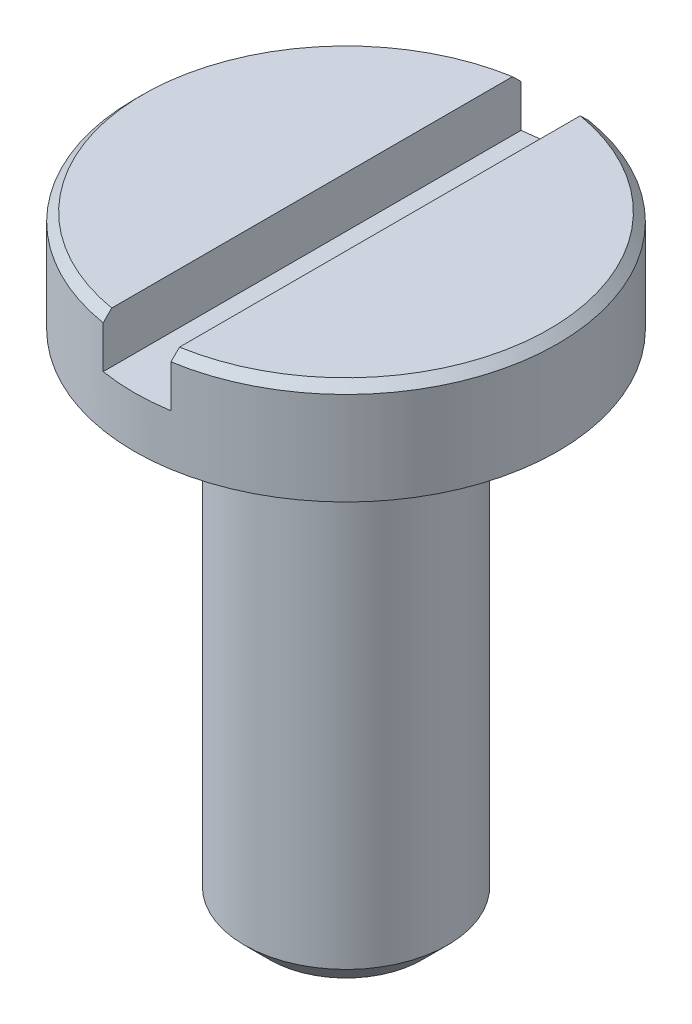
ISO-10303-21;
HEADER;
FILE_DESCRIPTION(('STEP AP214'),'2;1');
FILE_NAME('part.step','',(''),(''),'','','');
FILE_SCHEMA(('AUTOMOTIVE_DESIGN { 1 0 10303 214 1 1 1 1 }'));
ENDSEC;
DATA;
#1=APPLICATION_CONTEXT('core data for automotive mechanical design processes');
#2=APPLICATION_PROTOCOL_DEFINITION('international standard','automotive_design',2000,#1);
#3=PRODUCT_CONTEXT('',#1,'mechanical');
#4=PRODUCT('Part','Part','',(#3));
#5=PRODUCT_RELATED_PRODUCT_CATEGORY('part','',(#4));
#6=PRODUCT_DEFINITION_FORMATION('','',#4);
#7=PRODUCT_DEFINITION_CONTEXT('part definition',#1,'design');
#8=PRODUCT_DEFINITION('design','',#6,#7);
#9=PRODUCT_DEFINITION_SHAPE('','',#8);
#10=(LENGTH_UNIT() NAMED_UNIT(*) SI_UNIT(.MILLI.,.METRE.));
#11=(NAMED_UNIT(*) PLANE_ANGLE_UNIT() SI_UNIT($,.RADIAN.));
#12=(NAMED_UNIT(*) SI_UNIT($,.STERADIAN.) SOLID_ANGLE_UNIT());
#13=UNCERTAINTY_MEASURE_WITH_UNIT(LENGTH_MEASURE(1.E-05),#10,'distance_accuracy_value','');
#14=(GEOMETRIC_REPRESENTATION_CONTEXT(3) GLOBAL_UNCERTAINTY_ASSIGNED_CONTEXT((#13)) GLOBAL_UNIT_ASSIGNED_CONTEXT((#10,
#11,#12)) REPRESENTATION_CONTEXT('',''));
#15=CARTESIAN_POINT('',(0.,0.,0.));
#16=DIRECTION('',(0.,0.,1.));
#17=DIRECTION('',(1.,0.,0.));
#18=AXIS2_PLACEMENT_3D('',#15,#16,#17);
#19=CARTESIAN_POINT('',(0.,0.6,0.));
#20=DIRECTION('',(0.,1.,0.));
#21=DIRECTION('',(0.,0.,1.));
#22=AXIS2_PLACEMENT_3D('',#19,#20,#21);
#23=PLANE('',#22);
#24=DIRECTION('',(0.,0.,1.));
#25=VECTOR('',#24,1.);
#26=CARTESIAN_POINT('',(0.2,0.600000000000045,-1.25));
#27=LINE('',#26,#25);
#28=CARTESIAN_POINT('',(0.2,0.599999999999823,-1.18321595661988));
#29=VERTEX_POINT('',#28);
#30=CARTESIAN_POINT('',(0.2,0.599999999999823,1.18321595661988));
#31=VERTEX_POINT('',#30);
#32=EDGE_CURVE('E102',#29,#31,#27,.T.);
#33=ORIENTED_EDGE('',*,*,#32,.T.);
#34=CARTESIAN_POINT('',(0.,0.6,0.));
#35=DIRECTION('',(0.,1.,0.));
#36=DIRECTION('',(0.,0.,1.));
#37=AXIS2_PLACEMENT_3D('',#34,#35,#36);
#38=CIRCLE('',#37,1.2);
#39=EDGE_CURVE('E105',#31,#29,#38,.T.);
#40=ORIENTED_EDGE('',*,*,#39,.T.);
#41=EDGE_LOOP('',(#33,#40));
#42=FACE_BOUND('',#41,.T.);
#43=ADVANCED_FACE('F34',(#42),#23,.T.);
#44=CARTESIAN_POINT('',(0.,0.6,0.));
#45=DIRECTION('',(0.,-1.,0.));
#46=DIRECTION('',(0.,0.,-1.));
#47=AXIS2_PLACEMENT_3D('',#44,#45,#46);
#48=CONICAL_SURFACE('',#47,1.2,0.78539816339744);
#49=CARTESIAN_POINT('',(0.199999999999886,-0.950499970006001,2.74321892764739));
#50=CARTESIAN_POINT('',(0.199999999999893,-0.85521316276541,2.64767704238701));
#51=CARTESIAN_POINT('',(0.1999999999999,-0.759937513567608,2.55212401485427));
#52=CARTESIAN_POINT('',(0.199999999999914,-0.569420508066631,2.36097790814377));
#53=CARTESIAN_POINT('',(0.199999999999921,-0.474179152911256,2.26538482782206));
#54=CARTESIAN_POINT('',(0.199999999999935,-0.283680304847637,2.07407816347467));
#55=CARTESIAN_POINT('',(0.199999999999942,-0.188422849350493,1.97836454219386));
#56=CARTESIAN_POINT('',(0.199999999999956,0.00200973831289437,1.78686111472408));
#57=CARTESIAN_POINT('',(0.199999999999963,0.0971848728654708,1.69107131090932));
#58=CARTESIAN_POINT('',(0.199999999999977,0.286387712769196,1.50038687319419));
#59=CARTESIAN_POINT('',(0.199999999999984,0.38041680718345,1.40549361733739));
#60=CARTESIAN_POINT('',(0.199999999999998,0.568262322848238,1.2154799344842));
#61=CARTESIAN_POINT('',(0.200000000000005,0.662078724758933,1.12035948832674));
#62=CARTESIAN_POINT('',(0.200000000000015,0.802431191240111,0.977355461478562));
#63=CARTESIAN_POINT('',(0.200000000000018,0.849142887972829,0.929644297742755));
#64=CARTESIAN_POINT('',(0.200000000000025,0.942382748915012,0.834039211918449));
#65=CARTESIAN_POINT('',(0.200000000000029,0.988910906648579,0.786145283496622));
#66=CARTESIAN_POINT('',(0.200000000000035,1.08164699901678,0.690063753270319));
#67=CARTESIAN_POINT('',(0.200000000000039,1.12785498423148,0.641876200221872));
#68=CARTESIAN_POINT('',(0.200000000000046,1.21970773528638,0.544967994387595));
#69=CARTESIAN_POINT('',(0.200000000000049,1.26535254461765,0.496247383322212));
#70=CARTESIAN_POINT('',(0.200000000000053,1.32266782210179,0.433444864484505));
#71=CARTESIAN_POINT('',(0.200000000000054,1.33493377902086,0.41990768719576));
#72=CARTESIAN_POINT('',(0.200000000000056,1.35933321361233,0.392712938428519));
#73=CARTESIAN_POINT('',(0.200000000000057,1.37146668408859,0.37905536048243));
#74=CARTESIAN_POINT('',(0.200000000000059,1.40767513658386,0.337781215528018));
#75=CARTESIAN_POINT('',(0.200000000000061,1.43149053909029,0.309936528051617));
#76=CARTESIAN_POINT('',(0.200000000000064,1.47559765273767,0.255861694886954));
#77=CARTESIAN_POINT('',(0.200000000000066,1.49600843610721,0.229732167365978));
#78=CARTESIAN_POINT('',(0.200000000000068,1.52480518477775,0.18925858421655));
#79=CARTESIAN_POINT('',(0.200000000000069,1.53409437988248,0.175565259020838));
#80=CARTESIAN_POINT('',(0.20000000000007,1.55169168328672,0.147569344104482));
#81=CARTESIAN_POINT('',(0.200000000000071,1.56000099641343,0.133267532647374));
#82=CARTESIAN_POINT('',(0.200000000000072,1.57397551284466,0.105858050008022));
#83=CARTESIAN_POINT('',(0.200000000000072,1.57984745678161,0.0928587110503665));
#84=CARTESIAN_POINT('',(0.200000000000073,1.58969907939955,0.0661702015609263));
#85=CARTESIAN_POINT('',(0.200000000000073,1.5936851853496,0.0524835525617087));
#86=CARTESIAN_POINT('',(0.200000000000073,1.59850989657148,0.0269560064246883));
#87=CARTESIAN_POINT('',(0.200000000000073,1.59976945470394,0.0151985688248418));
#88=CARTESIAN_POINT('',(0.200000000000073,1.6001718043307,-0.00834316835147601));
#89=CARTESIAN_POINT('',(0.200000000000073,1.59931663499625,-0.0201274311120454));
#90=CARTESIAN_POINT('',(0.200000000000073,1.59516364543238,-0.046632359813152));
#91=CARTESIAN_POINT('',(0.200000000000073,1.5912493309678,-0.0612520830681338));
#92=CARTESIAN_POINT('',(0.200000000000072,1.58120047527907,-0.0897419347255407));
#93=CARTESIAN_POINT('',(0.200000000000072,1.57505325105002,-0.103607250128446));
#94=CARTESIAN_POINT('',(0.20000000000007,1.55683264697266,-0.139694012116542));
#95=CARTESIAN_POINT('',(0.200000000000069,1.54354967220904,-0.161283560008565));
#96=CARTESIAN_POINT('',(0.200000000000067,1.51522821534032,-0.203300232330449));
#97=CARTESIAN_POINT('',(0.200000000000066,1.50018421600613,-0.223723388178584));
#98=CARTESIAN_POINT('',(0.200000000000064,1.46906691381076,-0.263969274956352));
#99=CARTESIAN_POINT('',(0.200000000000063,1.45298784001529,-0.283787531009127));
#100=CARTESIAN_POINT('',(0.20000000000006,1.42030678861812,-0.322925503867143));
#101=CARTESIAN_POINT('',(0.200000000000059,1.40370572078283,-0.342245991712319));
#102=CARTESIAN_POINT('',(0.200000000000055,1.35391149998313,-0.399168778706729));
#103=CARTESIAN_POINT('',(0.200000000000053,1.32023024750236,-0.436342661674309));
#104=CARTESIAN_POINT('',(0.200000000000048,1.25224993849167,-0.510122852082956));
#105=CARTESIAN_POINT('',(0.200000000000045,1.2179507934654,-0.546729076802649));
#106=CARTESIAN_POINT('',(0.200000000000038,1.11448679964718,-0.656131274565132));
#107=CARTESIAN_POINT('',(0.200000000000033,1.04481402839601,-0.728446418955601));
#108=CARTESIAN_POINT('',(0.200000000000022,0.905416537934306,-0.872097092656359));
#109=CARTESIAN_POINT('',(0.200000000000017,0.835695199711297,-0.943435937459824));
#110=CARTESIAN_POINT('',(0.200000000000007,0.696002437153473,-1.08581877039426));
#111=CARTESIAN_POINT('',(0.200000000000002,0.626031111422726,-1.15686285505253));
#112=CARTESIAN_POINT('',(0.199999999999988,0.431455983866753,-1.35400414808119));
#113=CARTESIAN_POINT('',(0.199999999999979,0.306690384091999,-1.479941330513));
#114=CARTESIAN_POINT('',(0.19999999999996,0.0569299687690576,-1.73162420971081));
#115=CARTESIAN_POINT('',(0.199999999999951,-0.0680648773181554,-1.85736987615098));
#116=CARTESIAN_POINT('',(0.199999999999932,-0.319268602224971,-2.10984934365665));
#117=CARTESIAN_POINT('',(0.199999999999923,-0.445478504131675,-2.23658212643035));
#118=CARTESIAN_POINT('',(0.199999999999905,-0.697953823574084,-2.48995468743666));
#119=CARTESIAN_POINT('',(0.199999999999895,-0.824219230009358,-2.61659447672912));
#120=CARTESIAN_POINT('',(0.199999999999886,-0.950499970006002,-2.74321892764739));
#121=B_SPLINE_CURVE_WITH_KNOTS('',3,(#49,#50,#51,#52,#53,#54,#55,#56,#57,#58,#59,#60,#61,#62,
#63,#64,#65,#66,#67,#68,#69,#70,#71,#72,#73,#74,#75,#76,#77,#78,#79,#80,#81,#82,#83,#84,#85,#86,
#87,#88,#89,#90,#91,#92,#93,#94,#95,#96,#97,#98,#99,#100,#101,#102,#103,#104,#105,#106,#107,
#108,#109,#110,#111,#112,#113,#114,#115,#116,#117,#118,#119,#120),.UNSPECIFIED.,.F.,.F.,(4,2,2,
2,2,2,2,2,2,2,2,2,2,2,2,2,2,2,2,2,2,2,2,2,2,2,2,2,2,2,2,2,2,2,2,4),(0.,0.404809164288337,
0.809630808762067,1.21474277534173,1.61984257605578,2.02061153496668,2.42141558044582,
2.62172776074122,2.82204694664155,3.02233373006713,3.22260494836593,3.27740738256669,
3.33221277876293,3.44212264151892,3.5415107428698,3.59112809830151,3.64068379549018,
3.68338714841375,3.72594389320615,3.76124040239818,3.79650288944921,3.84163164166431,
3.88702084104461,3.96284904578586,4.03892151808884,4.11546271203283,4.19187718783774,
4.34234648879889,4.492837514494,4.79408069891004,5.0933346910438,5.39248141313244,
5.92430771282928,6.45621092333727,6.99278449758335,7.52927796906916),.UNSPECIFIED.);
#122=CARTESIAN_POINT('',(0.199999999999996,0.549999999999998,1.23389626792531));
#123=VERTEX_POINT('',#122);
#124=EDGE_CURVE('E172',#123,#31,#121,.T.);
#125=ORIENTED_EDGE('',*,*,#124,.F.);
#126=CARTESIAN_POINT('',(0.,0.549999999999998,0.));
#127=DIRECTION('',(0.,1.,0.));
#128=DIRECTION('',(0.,0.,1.));
#129=AXIS2_PLACEMENT_3D('',#126,#127,#128);
#130=CIRCLE('',#129,1.25);
#131=CARTESIAN_POINT('',(0.199999999999996,0.549999999999998,-1.23389626792531));
#132=VERTEX_POINT('',#131);
#133=EDGE_CURVE('E109',#132,#123,#130,.F.);
#134=ORIENTED_EDGE('',*,*,#133,.F.);
#135=EDGE_CURVE('E94',#29,#132,#121,.T.);
#136=ORIENTED_EDGE('',*,*,#135,.F.);
#137=ORIENTED_EDGE('',*,*,#39,.F.);
#138=EDGE_LOOP('',(#125,#134,#136,#137));
#139=FACE_BOUND('',#138,.T.);
#140=ADVANCED_FACE('F156',(#139),#48,.T.);
#141=CARTESIAN_POINT('',(0.,0.6,0.));
#142=DIRECTION('',(0.,-1.,0.));
#143=DIRECTION('',(0.,0.,-1.));
#144=AXIS2_PLACEMENT_3D('',#141,#142,#143);
#145=CYLINDRICAL_SURFACE('',#144,1.25);
#146=CARTESIAN_POINT('',(0.,0.299999999999877,0.));
#147=DIRECTION('',(0.,-1.,0.));
#148=DIRECTION('',(0.,0.,-1.));
#149=AXIS2_PLACEMENT_3D('',#146,#147,#148);
#150=CIRCLE('',#149,1.25);
#151=CARTESIAN_POINT('',(-0.199999999999978,0.299999999999877,-1.23389626792531));
#152=VERTEX_POINT('',#151);
#153=CARTESIAN_POINT('',(0.199999999999978,0.299999999999877,-1.23389626792531));
#154=VERTEX_POINT('',#153);
#155=EDGE_CURVE('E11',#152,#154,#150,.T.);
#156=ORIENTED_EDGE('',*,*,#155,.T.);
#157=DIRECTION('',(0.,-1.,0.));
#158=VECTOR('',#157,1.);
#159=CARTESIAN_POINT('',(0.2,0.599999999999985,-1.23389626792531));
#160=LINE('',#159,#158);
#161=EDGE_CURVE('E182',#154,#132,#160,.F.);
#162=ORIENTED_EDGE('',*,*,#161,.T.);
#163=ORIENTED_EDGE('',*,*,#133,.T.);
#164=DIRECTION('',(0.,-1.,0.));
#165=VECTOR('',#164,1.);
#166=CARTESIAN_POINT('',(0.2,0.599999999999985,1.23389626792531));
#167=LINE('',#166,#165);
#168=CARTESIAN_POINT('',(0.199999999999978,0.299999999999877,1.23389626792531));
#169=VERTEX_POINT('',#168);
#170=EDGE_CURVE('E57',#123,#169,#167,.T.);
#171=ORIENTED_EDGE('',*,*,#170,.T.);
#172=CARTESIAN_POINT('',(-0.199999999999978,0.299999999999877,1.23389626792531));
#173=VERTEX_POINT('',#172);
#174=EDGE_CURVE('E38',#169,#173,#150,.T.);
#175=ORIENTED_EDGE('',*,*,#174,.T.);
#176=DIRECTION('',(0.,-1.,0.));
#177=VECTOR('',#176,1.);
#178=CARTESIAN_POINT('',(-0.2,0.599999999999985,1.23389626792531));
#179=LINE('',#178,#177);
#180=CARTESIAN_POINT('',(-0.199999999999996,0.549999999999998,1.23389626792531));
#181=VERTEX_POINT('',#180);
#182=EDGE_CURVE('E177',#173,#181,#179,.F.);
#183=ORIENTED_EDGE('',*,*,#182,.T.);
#184=CARTESIAN_POINT('',(-0.199999999999996,0.549999999999998,-1.23389626792531));
#185=VERTEX_POINT('',#184);
#186=EDGE_CURVE('E117',#181,#185,#130,.F.);
#187=ORIENTED_EDGE('',*,*,#186,.T.);
#188=DIRECTION('',(0.,-1.,0.));
#189=VECTOR('',#188,1.);
#190=CARTESIAN_POINT('',(-0.2,0.599999999999985,-1.23389626792531));
#191=LINE('',#190,#189);
#192=EDGE_CURVE('E89',#185,#152,#191,.T.);
#193=ORIENTED_EDGE('',*,*,#192,.T.);
#194=EDGE_LOOP('',(#156,#162,#163,#171,#175,#183,#187,#193));
#195=FACE_BOUND('',#194,.T.);
#196=CARTESIAN_POINT('',(0.,0.,0.));
#197=DIRECTION('',(0.,1.,0.));
#198=DIRECTION('',(0.,0.,1.));
#199=AXIS2_PLACEMENT_3D('',#196,#197,#198);
#200=CIRCLE('',#199,1.25);
#201=CARTESIAN_POINT('',(0.,0.,1.25));
#202=VERTEX_POINT('',#201);
#203=EDGE_CURVE('E106',#202,#202,#200,.T.);
#204=ORIENTED_EDGE('',*,*,#203,.T.);
#205=EDGE_LOOP('',(#204));
#206=FACE_BOUND('',#205,.T.);
#207=ADVANCED_FACE('F152',(#195,#206),#145,.T.);
#208=DIRECTION('',(0.,0.,1.));
#209=VECTOR('',#208,1.);
#210=CARTESIAN_POINT('',(-0.2,0.600000000000045,-1.25));
#211=LINE('',#210,#209);
#212=CARTESIAN_POINT('',(-0.2,0.600000000000045,-1.1832159566201));
#213=VERTEX_POINT('',#212);
#214=CARTESIAN_POINT('',(-0.199999999999971,0.6,1.18321595661993));
#215=VERTEX_POINT('',#214);
#216=EDGE_CURVE('E49',#213,#215,#211,.T.);
#217=ORIENTED_EDGE('',*,*,#216,.F.);
#218=EDGE_CURVE('E100',#213,#215,#38,.T.);
#219=ORIENTED_EDGE('',*,*,#218,.T.);
#220=EDGE_LOOP('',(#217,#219));
#221=FACE_BOUND('',#220,.T.);
#222=ADVANCED_FACE('F99',(#221),#23,.T.);
#223=CARTESIAN_POINT('',(0.,0.,0.));
#224=DIRECTION('',(0.,1.,0.));
#225=DIRECTION('',(0.,0.,1.));
#226=AXIS2_PLACEMENT_3D('',#223,#224,#225);
#227=PLANE('',#226);
#228=CARTESIAN_POINT('',(0.,0.,0.));
#229=DIRECTION('',(0.,1.,0.));
#230=DIRECTION('',(0.,0.,1.));
#231=AXIS2_PLACEMENT_3D('',#228,#229,#230);
#232=CIRCLE('',#231,0.6);
#233=CARTESIAN_POINT('',(0.,0.,0.6));
#234=VERTEX_POINT('',#233);
#235=EDGE_CURVE('E111',#234,#234,#232,.T.);
#236=ORIENTED_EDGE('',*,*,#235,.T.);
#237=EDGE_LOOP('',(#236));
#238=FACE_BOUND('',#237,.T.);
#239=ORIENTED_EDGE('',*,*,#203,.F.);
#240=EDGE_LOOP('',(#239));
#241=FACE_BOUND('',#240,.T.);
#242=ADVANCED_FACE('F148',(#238,#241),#227,.F.);
#243=CARTESIAN_POINT('',(0.,-3.,0.));
#244=DIRECTION('',(0.,1.,0.));
#245=DIRECTION('',(0.,0.,1.));
#246=AXIS2_PLACEMENT_3D('',#243,#244,#245);
#247=CYLINDRICAL_SURFACE('',#246,0.6);
#248=CARTESIAN_POINT('',(0.,-2.85,0.));
#249=DIRECTION('',(0.,1.,0.));
#250=DIRECTION('',(0.,0.,1.));
#251=AXIS2_PLACEMENT_3D('',#248,#249,#250);
#252=CIRCLE('',#251,0.6);
#253=CARTESIAN_POINT('',(0.,-2.85,0.6));
#254=VERTEX_POINT('',#253);
#255=EDGE_CURVE('E118',#254,#254,#252,.T.);
#256=ORIENTED_EDGE('',*,*,#255,.T.);
#257=EDGE_LOOP('',(#256));
#258=FACE_BOUND('',#257,.T.);
#259=ORIENTED_EDGE('',*,*,#235,.F.);
#260=EDGE_LOOP('',(#259));
#261=FACE_BOUND('',#260,.T.);
#262=ADVANCED_FACE('F144',(#258,#261),#247,.T.);
#263=CARTESIAN_POINT('',(0.,-3.,0.));
#264=DIRECTION('',(0.,1.,0.));
#265=DIRECTION('',(0.,0.,1.));
#266=AXIS2_PLACEMENT_3D('',#263,#264,#265);
#267=PLANE('',#266);
#268=CARTESIAN_POINT('',(0.,-3.,0.));
#269=DIRECTION('',(0.,1.,0.));
#270=DIRECTION('',(0.,0.,1.));
#271=AXIS2_PLACEMENT_3D('',#268,#269,#270);
#272=CIRCLE('',#271,0.449999999999999);
#273=CARTESIAN_POINT('',(0.,-3.,0.449999999999999));
#274=VERTEX_POINT('',#273);
#275=EDGE_CURVE('E121',#274,#274,#272,.F.);
#276=ORIENTED_EDGE('',*,*,#275,.T.);
#277=EDGE_LOOP('',(#276));
#278=FACE_BOUND('',#277,.T.);
#279=ADVANCED_FACE('F141',(#278),#267,.F.);
#280=CARTESIAN_POINT('',(-0.199999999999886,-0.950499970006001,-2.74321892764739));
#281=CARTESIAN_POINT('',(-0.199999999999893,-0.85521316276541,-2.64767704238701));
#282=CARTESIAN_POINT('',(-0.1999999999999,-0.759937513567608,-2.55212401485427));
#283=CARTESIAN_POINT('',(-0.199999999999914,-0.569420508066631,-2.36097790814377));
#284=CARTESIAN_POINT('',(-0.199999999999921,-0.474179152911257,-2.26538482782206));
#285=CARTESIAN_POINT('',(-0.199999999999935,-0.283680304847639,-2.07407816347467));
#286=CARTESIAN_POINT('',(-0.199999999999942,-0.188422849350494,-1.97836454219386));
#287=CARTESIAN_POINT('',(-0.199999999999956,0.00200973831289268,-1.78686111472408));
#288=CARTESIAN_POINT('',(-0.199999999999963,0.097184872865469,-1.69107131090932));
#289=CARTESIAN_POINT('',(-0.199999999999977,0.286387712769194,-1.5003868731942));
#290=CARTESIAN_POINT('',(-0.199999999999984,0.380416807183448,-1.40549361733739));
#291=CARTESIAN_POINT('',(-0.199999999999998,0.568262322848236,-1.2154799344842));
#292=CARTESIAN_POINT('',(-0.200000000000005,0.662078724758932,-1.12035948832674));
#293=CARTESIAN_POINT('',(-0.200000000000015,0.80243119124011,-0.977355461478563));
#294=CARTESIAN_POINT('',(-0.200000000000018,0.849142887972828,-0.929644297742756));
#295=CARTESIAN_POINT('',(-0.200000000000025,0.942382748915011,-0.83403921191845));
#296=CARTESIAN_POINT('',(-0.200000000000029,0.988910906648578,-0.786145283496623));
#297=CARTESIAN_POINT('',(-0.200000000000035,1.08164699901678,-0.69006375327032));
#298=CARTESIAN_POINT('',(-0.200000000000039,1.12785498423148,-0.641876200221873));
#299=CARTESIAN_POINT('',(-0.200000000000046,1.21970773528638,-0.544967994387596));
#300=CARTESIAN_POINT('',(-0.200000000000049,1.26535254461765,-0.496247383322213));
#301=CARTESIAN_POINT('',(-0.200000000000053,1.32266782210179,-0.433444864484506));
#302=CARTESIAN_POINT('',(-0.200000000000054,1.33493377902085,-0.419907687195761));
#303=CARTESIAN_POINT('',(-0.200000000000056,1.35933321361233,-0.39271293842852));
#304=CARTESIAN_POINT('',(-0.200000000000057,1.37146668408859,-0.37905536048243));
#305=CARTESIAN_POINT('',(-0.200000000000059,1.40767513658386,-0.337781215528018));
#306=CARTESIAN_POINT('',(-0.200000000000061,1.43149053909029,-0.309936528051618));
#307=CARTESIAN_POINT('',(-0.200000000000064,1.47559765273767,-0.255861694886955));
#308=CARTESIAN_POINT('',(-0.200000000000066,1.49600843610721,-0.229732167365978));
#309=CARTESIAN_POINT('',(-0.200000000000068,1.52480518477775,-0.18925858421655));
#310=CARTESIAN_POINT('',(-0.200000000000069,1.53409437988248,-0.175565259020838));
#311=CARTESIAN_POINT('',(-0.20000000000007,1.55169168328672,-0.147569344104481));
#312=CARTESIAN_POINT('',(-0.200000000000071,1.56000099641343,-0.133267532647373));
#313=CARTESIAN_POINT('',(-0.200000000000072,1.57397551284466,-0.105858050008022));
#314=CARTESIAN_POINT('',(-0.200000000000072,1.57984745678161,-0.0928587110503661));
#315=CARTESIAN_POINT('',(-0.200000000000073,1.58969907939955,-0.0661702015609259));
#316=CARTESIAN_POINT('',(-0.200000000000073,1.5936851853496,-0.0524835525617083));
#317=CARTESIAN_POINT('',(-0.200000000000073,1.59850989657148,-0.0269560064246879));
#318=CARTESIAN_POINT('',(-0.200000000000073,1.59976945470394,-0.0151985688248413));
#319=CARTESIAN_POINT('',(-0.200000000000073,1.6001718043307,0.00834316835147648));
#320=CARTESIAN_POINT('',(-0.200000000000073,1.59931663499625,0.0201274311120459));
#321=CARTESIAN_POINT('',(-0.200000000000073,1.59516364543238,0.0466323598131525));
#322=CARTESIAN_POINT('',(-0.200000000000073,1.5912493309678,0.0612520830681344));
#323=CARTESIAN_POINT('',(-0.200000000000072,1.58120047527907,0.0897419347255414));
#324=CARTESIAN_POINT('',(-0.200000000000072,1.57505325105002,0.103607250128447));
#325=CARTESIAN_POINT('',(-0.20000000000007,1.55683264697266,0.139694012116543));
#326=CARTESIAN_POINT('',(-0.200000000000069,1.54354967220904,0.161283560008567));
#327=CARTESIAN_POINT('',(-0.200000000000067,1.51522821534031,0.203300232330451));
#328=CARTESIAN_POINT('',(-0.200000000000066,1.50018421600613,0.223723388178586));
#329=CARTESIAN_POINT('',(-0.200000000000064,1.46906691381076,0.263969274956354));
#330=CARTESIAN_POINT('',(-0.200000000000063,1.45298784001529,0.28378753100913));
#331=CARTESIAN_POINT('',(-0.20000000000006,1.42030678861812,0.322925503867146));
#332=CARTESIAN_POINT('',(-0.200000000000059,1.40370572078283,0.342245991712322));
#333=CARTESIAN_POINT('',(-0.200000000000055,1.35391149998313,0.399168778706733));
#334=CARTESIAN_POINT('',(-0.200000000000053,1.32023024750236,0.436342661674313));
#335=CARTESIAN_POINT('',(-0.200000000000048,1.25224993849166,0.510122852082961));
#336=CARTESIAN_POINT('',(-0.200000000000045,1.21795079346539,0.546729076802654));
#337=CARTESIAN_POINT('',(-0.200000000000038,1.11448679964718,0.656131274565139));
#338=CARTESIAN_POINT('',(-0.200000000000033,1.044814028396,0.728446418955608));
#339=CARTESIAN_POINT('',(-0.200000000000022,0.905416537934298,0.872097092656367));
#340=CARTESIAN_POINT('',(-0.200000000000017,0.835695199711288,0.943435937459833));
#341=CARTESIAN_POINT('',(-0.200000000000007,0.696002437153462,1.08581877039427));
#342=CARTESIAN_POINT('',(-0.200000000000002,0.626031111422714,1.15686285505254));
#343=CARTESIAN_POINT('',(-0.199999999999988,0.431455983866742,1.3540041480812));
#344=CARTESIAN_POINT('',(-0.199999999999979,0.306690384091988,1.47994133051302));
#345=CARTESIAN_POINT('',(-0.19999999999996,0.0569299687690492,1.73162420971082));
#346=CARTESIAN_POINT('',(-0.199999999999951,-0.0680648773181626,1.85736987615099));
#347=CARTESIAN_POINT('',(-0.199999999999932,-0.319268602224977,2.10984934365665));
#348=CARTESIAN_POINT('',(-0.199999999999923,-0.445478504131679,2.23658212643035));
#349=CARTESIAN_POINT('',(-0.199999999999905,-0.697953823574086,2.48995468743666));
#350=CARTESIAN_POINT('',(-0.199999999999895,-0.824219230009359,2.61659447672912));
#351=CARTESIAN_POINT('',(-0.199999999999886,-0.950499970006001,2.74321892764739));
#352=B_SPLINE_CURVE_WITH_KNOTS('',3,(#280,#281,#282,#283,#284,#285,#286,#287,#288,#289,#290,
#291,#292,#293,#294,#295,#296,#297,#298,#299,#300,#301,#302,#303,#304,#305,#306,#307,#308,#309,
#310,#311,#312,#313,#314,#315,#316,#317,#318,#319,#320,#321,#322,#323,#324,#325,#326,#327,#328,
#329,#330,#331,#332,#333,#334,#335,#336,#337,#338,#339,#340,#341,#342,#343,#344,#345,#346,#347,
#348,#349,#350,#351),.UNSPECIFIED.,.F.,.F.,(4,2,2,2,2,2,2,2,2,2,2,2,2,2,2,2,2,2,2,2,2,2,2,2,2,2,
2,2,2,2,2,2,2,2,2,4),(0.,0.404809164288336,0.809630808762066,1.21474277534173,1.61984257605578,
2.02061153496668,2.42141558044582,2.62172776074122,2.82204694664155,3.02233373006713,
3.22260494836593,3.27740738256669,3.33221277876293,3.44212264151892,3.5415107428698,
3.59112809830151,3.64068379549019,3.68338714841375,3.72594389320615,3.76124040239818,
3.79650288944921,3.84163164166431,3.88702084104461,3.96284904578586,4.03892151808884,
4.11546271203284,4.19187718783774,4.34234648879889,4.49283751449401,4.79408069891005,
5.09333469104382,5.39248141313246,5.92430771282929,6.45621092333728,6.99278449758336,
7.52927796906916),.UNSPECIFIED.);
#353=EDGE_CURVE('E85',#185,#213,#352,.T.);
#354=ORIENTED_EDGE('',*,*,#353,.F.);
#355=ORIENTED_EDGE('',*,*,#186,.F.);
#356=EDGE_CURVE('E95',#215,#181,#352,.T.);
#357=ORIENTED_EDGE('',*,*,#356,.F.);
#358=ORIENTED_EDGE('',*,*,#218,.F.);
#359=EDGE_LOOP('',(#354,#355,#357,#358));
#360=FACE_BOUND('',#359,.T.);
#361=ADVANCED_FACE('F104',(#360),#48,.T.);
#362=CARTESIAN_POINT('',(0.,-2.85,0.));
#363=DIRECTION('',(0.,1.,0.));
#364=DIRECTION('',(0.,0.,1.));
#365=AXIS2_PLACEMENT_3D('',#362,#363,#364);
#366=CONICAL_SURFACE('',#365,0.6,0.785398163397451);
#367=ORIENTED_EDGE('',*,*,#275,.F.);
#368=EDGE_LOOP('',(#367));
#369=FACE_BOUND('',#368,.T.);
#370=ORIENTED_EDGE('',*,*,#255,.F.);
#371=EDGE_LOOP('',(#370));
#372=FACE_BOUND('',#371,.T.);
#373=ADVANCED_FACE('F36',(#369,#372),#366,.T.);
#374=CARTESIAN_POINT('',(0.199999999999978,0.299999999999877,-1.25));
#375=DIRECTION('',(0.,-1.,0.));
#376=DIRECTION('',(0.,0.,-1.));
#377=AXIS2_PLACEMENT_3D('',#374,#375,#376);
#378=PLANE('',#377);
#379=DIRECTION('',(0.,0.,1.));
#380=VECTOR('',#379,1.);
#381=CARTESIAN_POINT('',(0.199999999999978,0.299999999999877,-1.25));
#382=LINE('',#381,#380);
#383=EDGE_CURVE('E181',#154,#169,#382,.T.);
#384=ORIENTED_EDGE('',*,*,#383,.F.);
#385=ORIENTED_EDGE('',*,*,#155,.F.);
#386=DIRECTION('',(0.,0.,1.));
#387=VECTOR('',#386,1.);
#388=CARTESIAN_POINT('',(-0.199999999999978,0.299999999999877,-1.25));
#389=LINE('',#388,#387);
#390=EDGE_CURVE('E101',#152,#173,#389,.T.);
#391=ORIENTED_EDGE('',*,*,#390,.T.);
#392=ORIENTED_EDGE('',*,*,#174,.F.);
#393=EDGE_LOOP('',(#384,#385,#391,#392));
#394=FACE_BOUND('',#393,.T.);
#395=ADVANCED_FACE('F137',(#394),#378,.F.);
#396=CARTESIAN_POINT('',(0.2,0.600000000000045,-1.25));
#397=DIRECTION('',(1.,0.,0.));
#398=DIRECTION('',(0.,1.,0.));
#399=AXIS2_PLACEMENT_3D('',#396,#397,#398);
#400=PLANE('',#399);
#401=ORIENTED_EDGE('',*,*,#124,.T.);
#402=ORIENTED_EDGE('',*,*,#32,.F.);
#403=ORIENTED_EDGE('',*,*,#135,.T.);
#404=ORIENTED_EDGE('',*,*,#161,.F.);
#405=ORIENTED_EDGE('',*,*,#383,.T.);
#406=ORIENTED_EDGE('',*,*,#170,.F.);
#407=EDGE_LOOP('',(#401,#402,#403,#404,#405,#406));
#408=FACE_BOUND('',#407,.T.);
#409=ADVANCED_FACE('F136',(#408),#400,.F.);
#410=CARTESIAN_POINT('',(-0.2,0.600000000000045,-1.25));
#411=DIRECTION('',(-1.,0.,0.));
#412=DIRECTION('',(0.,-1.,0.));
#413=AXIS2_PLACEMENT_3D('',#410,#411,#412);
#414=PLANE('',#413);
#415=ORIENTED_EDGE('',*,*,#353,.T.);
#416=ORIENTED_EDGE('',*,*,#216,.T.);
#417=ORIENTED_EDGE('',*,*,#356,.T.);
#418=ORIENTED_EDGE('',*,*,#182,.F.);
#419=ORIENTED_EDGE('',*,*,#390,.F.);
#420=ORIENTED_EDGE('',*,*,#192,.F.);
#421=EDGE_LOOP('',(#415,#416,#417,#418,#419,#420));
#422=FACE_BOUND('',#421,.T.);
#423=ADVANCED_FACE('F86',(#422),#414,.F.);
#424=CLOSED_SHELL('',(#43,#140,#207,#222,#242,#262,#279,#361,#373,#395,#409,#423));
#425=MANIFOLD_SOLID_BREP('B2',#424);
#426=ADVANCED_BREP_SHAPE_REPRESENTATION('',(#18,#425),#14);
#427=SHAPE_DEFINITION_REPRESENTATION(#9,#426);
ENDSEC;
END-ISO-10303-21;
